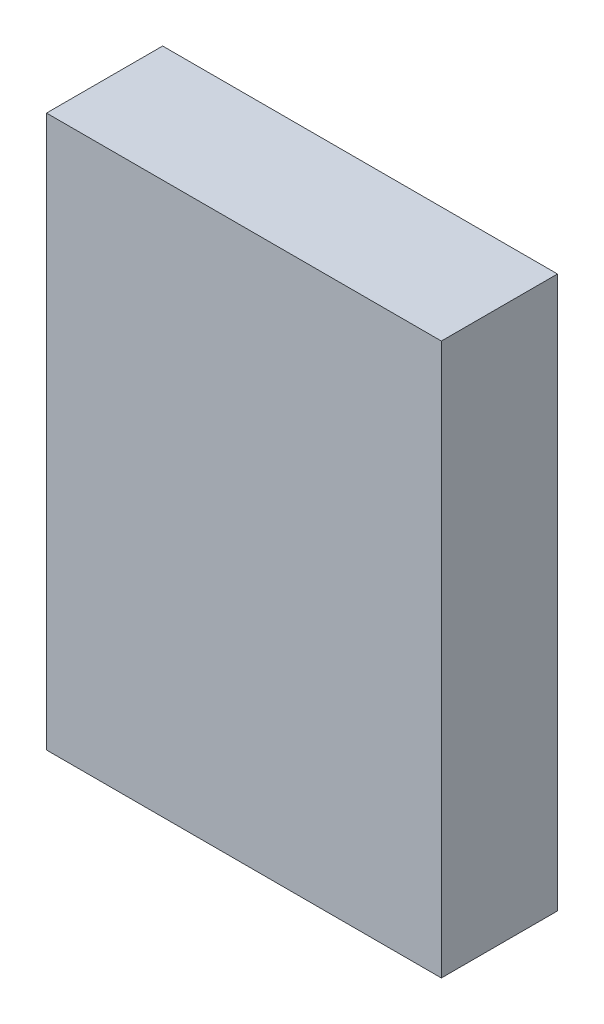
ISO-10303-21;
HEADER;
FILE_DESCRIPTION(('STEP AP214'),'2;1');
FILE_NAME('part.step','',(''),(''),'','','');
FILE_SCHEMA(('AUTOMOTIVE_DESIGN { 1 0 10303 214 1 1 1 1 }'));
ENDSEC;
DATA;
#1=APPLICATION_CONTEXT('core data for automotive mechanical design processes');
#2=APPLICATION_PROTOCOL_DEFINITION('international standard','automotive_design',2000,#1);
#3=PRODUCT_CONTEXT('',#1,'mechanical');
#4=PRODUCT('Part','Part','',(#3));
#5=PRODUCT_RELATED_PRODUCT_CATEGORY('part','',(#4));
#6=PRODUCT_DEFINITION_FORMATION('','',#4);
#7=PRODUCT_DEFINITION_CONTEXT('part definition',#1,'design');
#8=PRODUCT_DEFINITION('design','',#6,#7);
#9=PRODUCT_DEFINITION_SHAPE('','',#8);
#10=(LENGTH_UNIT() NAMED_UNIT(*) SI_UNIT(.MILLI.,.METRE.));
#11=(NAMED_UNIT(*) PLANE_ANGLE_UNIT() SI_UNIT($,.RADIAN.));
#12=(NAMED_UNIT(*) SI_UNIT($,.STERADIAN.) SOLID_ANGLE_UNIT());
#13=UNCERTAINTY_MEASURE_WITH_UNIT(LENGTH_MEASURE(1.E-05),#10,'distance_accuracy_value','');
#14=(GEOMETRIC_REPRESENTATION_CONTEXT(3) GLOBAL_UNCERTAINTY_ASSIGNED_CONTEXT((#13)) GLOBAL_UNIT_ASSIGNED_CONTEXT((#10,
#11,#12)) REPRESENTATION_CONTEXT('',''));
#15=CARTESIAN_POINT('',(0.,0.,0.));
#16=DIRECTION('',(0.,0.,1.));
#17=DIRECTION('',(1.,0.,0.));
#18=AXIS2_PLACEMENT_3D('',#15,#16,#17);
#19=CARTESIAN_POINT('',(-34.,47.5,-10.));
#20=DIRECTION('',(1.,0.,0.));
#21=DIRECTION('',(0.,0.,-1.));
#22=AXIS2_PLACEMENT_3D('',#19,#20,#21);
#23=PLANE('',#22);
#24=DIRECTION('',(0.,0.,1.));
#25=VECTOR('',#24,1.);
#26=CARTESIAN_POINT('',(-34.,-47.5,-10.));
#27=LINE('',#26,#25);
#28=CARTESIAN_POINT('',(-34.,-47.5,-10.));
#29=VERTEX_POINT('',#28);
#30=CARTESIAN_POINT('',(-34.,-47.5,10.));
#31=VERTEX_POINT('',#30);
#32=EDGE_CURVE('E113',#29,#31,#27,.T.);
#33=ORIENTED_EDGE('',*,*,#32,.T.);
#34=DIRECTION('',(0.,-1.,0.));
#35=VECTOR('',#34,1.);
#36=CARTESIAN_POINT('',(-34.,47.5,10.));
#37=LINE('',#36,#35);
#38=CARTESIAN_POINT('',(-34.,47.5,10.));
#39=VERTEX_POINT('',#38);
#40=EDGE_CURVE('E11',#39,#31,#37,.T.);
#41=ORIENTED_EDGE('',*,*,#40,.F.);
#42=DIRECTION('',(0.,0.,1.));
#43=VECTOR('',#42,1.);
#44=CARTESIAN_POINT('',(-34.,47.5,-10.));
#45=LINE('',#44,#43);
#46=CARTESIAN_POINT('',(-34.,47.5,-10.));
#47=VERTEX_POINT('',#46);
#48=EDGE_CURVE('E97',#47,#39,#45,.T.);
#49=ORIENTED_EDGE('',*,*,#48,.F.);
#50=DIRECTION('',(0.,-1.,0.));
#51=VECTOR('',#50,1.);
#52=CARTESIAN_POINT('',(-34.,47.5,-10.));
#53=LINE('',#52,#51);
#54=EDGE_CURVE('E109',#47,#29,#53,.T.);
#55=ORIENTED_EDGE('',*,*,#54,.T.);
#56=EDGE_LOOP('',(#33,#41,#49,#55));
#57=FACE_BOUND('',#56,.T.);
#58=ADVANCED_FACE('F45',(#57),#23,.F.);
#59=CARTESIAN_POINT('',(-34.,47.5,10.));
#60=DIRECTION('',(0.,0.,-1.));
#61=DIRECTION('',(-1.,0.,0.));
#62=AXIS2_PLACEMENT_3D('',#59,#60,#61);
#63=PLANE('',#62);
#64=DIRECTION('',(1.,0.,0.));
#65=VECTOR('',#64,1.);
#66=CARTESIAN_POINT('',(-34.,-47.5,10.));
#67=LINE('',#66,#65);
#68=CARTESIAN_POINT('',(34.,-47.5,10.));
#69=VERTEX_POINT('',#68);
#70=EDGE_CURVE('E102',#31,#69,#67,.T.);
#71=ORIENTED_EDGE('',*,*,#70,.T.);
#72=DIRECTION('',(0.,-1.,0.));
#73=VECTOR('',#72,1.);
#74=CARTESIAN_POINT('',(34.,47.5,10.));
#75=LINE('',#74,#73);
#76=CARTESIAN_POINT('',(34.,47.5,10.));
#77=VERTEX_POINT('',#76);
#78=EDGE_CURVE('E54',#77,#69,#75,.T.);
#79=ORIENTED_EDGE('',*,*,#78,.F.);
#80=DIRECTION('',(1.,0.,0.));
#81=VECTOR('',#80,1.);
#82=CARTESIAN_POINT('',(-34.,47.5,10.));
#83=LINE('',#82,#81);
#84=EDGE_CURVE('E92',#39,#77,#83,.T.);
#85=ORIENTED_EDGE('',*,*,#84,.F.);
#86=ORIENTED_EDGE('',*,*,#40,.T.);
#87=EDGE_LOOP('',(#71,#79,#85,#86));
#88=FACE_BOUND('',#87,.T.);
#89=ADVANCED_FACE('F101',(#88),#63,.F.);
#90=CARTESIAN_POINT('',(34.,47.5,-10.));
#91=DIRECTION('',(-1.,0.,0.));
#92=DIRECTION('',(0.,0.,1.));
#93=AXIS2_PLACEMENT_3D('',#90,#91,#92);
#94=PLANE('',#93);
#95=DIRECTION('',(0.,0.,-1.));
#96=VECTOR('',#95,1.);
#97=CARTESIAN_POINT('',(34.,-47.5,-10.));
#98=LINE('',#97,#96);
#99=CARTESIAN_POINT('',(34.,-47.5,-10.));
#100=VERTEX_POINT('',#99);
#101=EDGE_CURVE('E79',#69,#100,#98,.T.);
#102=ORIENTED_EDGE('',*,*,#101,.T.);
#103=DIRECTION('',(0.,-1.,0.));
#104=VECTOR('',#103,1.);
#105=CARTESIAN_POINT('',(34.,47.5,-10.));
#106=LINE('',#105,#104);
#107=CARTESIAN_POINT('',(34.,47.5,-10.));
#108=VERTEX_POINT('',#107);
#109=EDGE_CURVE('E104',#108,#100,#106,.T.);
#110=ORIENTED_EDGE('',*,*,#109,.F.);
#111=DIRECTION('',(0.,0.,-1.));
#112=VECTOR('',#111,1.);
#113=CARTESIAN_POINT('',(34.,47.5,-10.));
#114=LINE('',#113,#112);
#115=EDGE_CURVE('E95',#77,#108,#114,.T.);
#116=ORIENTED_EDGE('',*,*,#115,.F.);
#117=ORIENTED_EDGE('',*,*,#78,.T.);
#118=EDGE_LOOP('',(#102,#110,#116,#117));
#119=FACE_BOUND('',#118,.T.);
#120=ADVANCED_FACE('F105',(#119),#94,.F.);
#121=CARTESIAN_POINT('',(-34.,47.5,-10.));
#122=DIRECTION('',(0.,0.,1.));
#123=DIRECTION('',(1.,0.,0.));
#124=AXIS2_PLACEMENT_3D('',#121,#122,#123);
#125=PLANE('',#124);
#126=DIRECTION('',(-1.,0.,0.));
#127=VECTOR('',#126,1.);
#128=CARTESIAN_POINT('',(-34.,-47.5,-10.));
#129=LINE('',#128,#127);
#130=EDGE_CURVE('E85',#100,#29,#129,.T.);
#131=ORIENTED_EDGE('',*,*,#130,.T.);
#132=ORIENTED_EDGE('',*,*,#54,.F.);
#133=DIRECTION('',(-1.,0.,0.));
#134=VECTOR('',#133,1.);
#135=CARTESIAN_POINT('',(-34.,47.5,-10.));
#136=LINE('',#135,#134);
#137=EDGE_CURVE('E62',#108,#47,#136,.T.);
#138=ORIENTED_EDGE('',*,*,#137,.F.);
#139=ORIENTED_EDGE('',*,*,#109,.T.);
#140=EDGE_LOOP('',(#131,#132,#138,#139));
#141=FACE_BOUND('',#140,.T.);
#142=ADVANCED_FACE('F126',(#141),#125,.F.);
#143=CARTESIAN_POINT('',(0.,47.5,0.));
#144=DIRECTION('',(0.,1.,0.));
#145=DIRECTION('',(0.,0.,1.));
#146=AXIS2_PLACEMENT_3D('',#143,#144,#145);
#147=PLANE('',#146);
#148=ORIENTED_EDGE('',*,*,#48,.T.);
#149=ORIENTED_EDGE('',*,*,#84,.T.);
#150=ORIENTED_EDGE('',*,*,#115,.T.);
#151=ORIENTED_EDGE('',*,*,#137,.T.);
#152=EDGE_LOOP('',(#148,#149,#150,#151));
#153=FACE_BOUND('',#152,.T.);
#154=ADVANCED_FACE('F93',(#153),#147,.T.);
#155=CARTESIAN_POINT('',(0.,-47.5,0.));
#156=DIRECTION('',(0.,1.,0.));
#157=DIRECTION('',(0.,0.,1.));
#158=AXIS2_PLACEMENT_3D('',#155,#156,#157);
#159=PLANE('',#158);
#160=ORIENTED_EDGE('',*,*,#32,.F.);
#161=ORIENTED_EDGE('',*,*,#130,.F.);
#162=ORIENTED_EDGE('',*,*,#101,.F.);
#163=ORIENTED_EDGE('',*,*,#70,.F.);
#164=EDGE_LOOP('',(#160,#161,#162,#163));
#165=FACE_BOUND('',#164,.T.);
#166=ADVANCED_FACE('F129',(#165),#159,.F.);
#167=CLOSED_SHELL('',(#58,#89,#120,#142,#154,#166));
#168=MANIFOLD_SOLID_BREP('B2',#167);
#169=ADVANCED_BREP_SHAPE_REPRESENTATION('',(#18,#168),#14);
#170=SHAPE_DEFINITION_REPRESENTATION(#9,#169);
ENDSEC;
END-ISO-10303-21;
